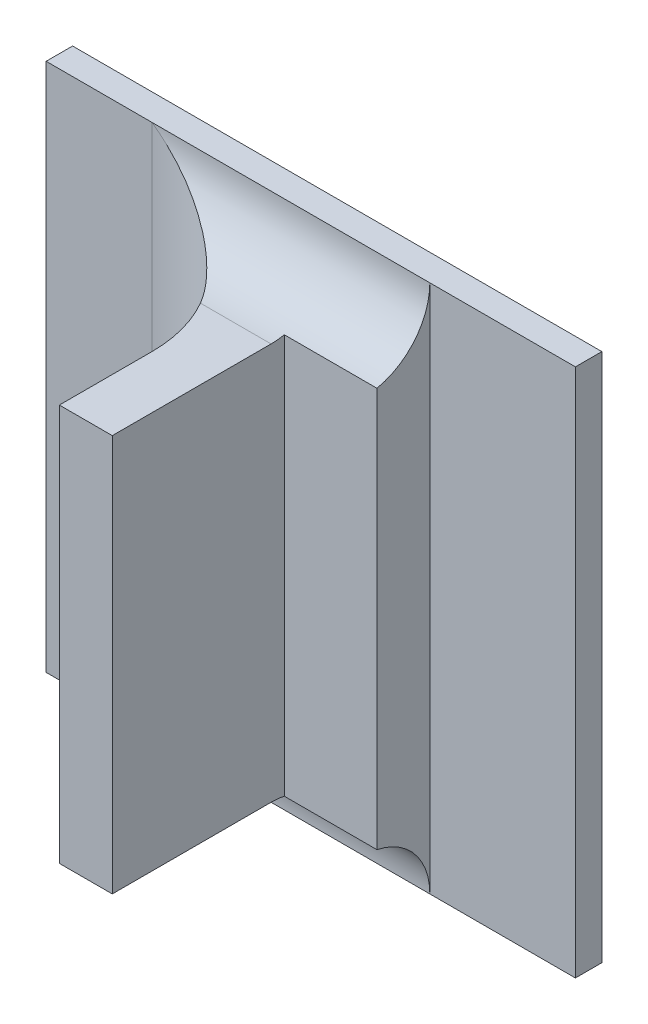
ISO-10303-21;
HEADER;
FILE_DESCRIPTION(('STEP AP214'),'2;1');
FILE_NAME('part.step','',(''),(''),'','','');
FILE_SCHEMA(('AUTOMOTIVE_DESIGN { 1 0 10303 214 1 1 1 1 }'));
ENDSEC;
DATA;
#1=APPLICATION_CONTEXT('core data for automotive mechanical design processes');
#2=APPLICATION_PROTOCOL_DEFINITION('international standard','automotive_design',2000,#1);
#3=PRODUCT_CONTEXT('',#1,'mechanical');
#4=PRODUCT('Part','Part','',(#3));
#5=PRODUCT_RELATED_PRODUCT_CATEGORY('part','',(#4));
#6=PRODUCT_DEFINITION_FORMATION('','',#4);
#7=PRODUCT_DEFINITION_CONTEXT('part definition',#1,'design');
#8=PRODUCT_DEFINITION('design','',#6,#7);
#9=PRODUCT_DEFINITION_SHAPE('','',#8);
#10=(LENGTH_UNIT() NAMED_UNIT(*) SI_UNIT(.MILLI.,.METRE.));
#11=(NAMED_UNIT(*) PLANE_ANGLE_UNIT() SI_UNIT($,.RADIAN.));
#12=(NAMED_UNIT(*) SI_UNIT($,.STERADIAN.) SOLID_ANGLE_UNIT());
#13=UNCERTAINTY_MEASURE_WITH_UNIT(LENGTH_MEASURE(1.E-05),#10,'distance_accuracy_value','');
#14=(GEOMETRIC_REPRESENTATION_CONTEXT(3) GLOBAL_UNCERTAINTY_ASSIGNED_CONTEXT((#13)) GLOBAL_UNIT_ASSIGNED_CONTEXT((#10,
#11,#12)) REPRESENTATION_CONTEXT('',''));
#15=CARTESIAN_POINT('',(0.,0.,0.));
#16=DIRECTION('',(0.,0.,1.));
#17=DIRECTION('',(1.,0.,0.));
#18=AXIS2_PLACEMENT_3D('',#15,#16,#17);
#19=CARTESIAN_POINT('',(0.959904218627624,-0.311549667580545,0.0888870078740156));
#20=DIRECTION('',(0.,0.,1.));
#21=DIRECTION('',(1.,0.,0.));
#22=AXIS2_PLACEMENT_3D('',#19,#20,#21);
#23=PLANE('',#22);
#24=DIRECTION('',(1.,0.,0.));
#25=VECTOR('',#24,1.);
#26=CARTESIAN_POINT('',(0.952588649165875,-0.351234706950624,0.0888870078740156));
#27=LINE('',#26,#25);
#28=CARTESIAN_POINT('',(0.959652250123687,-0.351234706950624,0.0888870078740156));
#29=VERTEX_POINT('',#28);
#30=CARTESIAN_POINT('',(0.954612880044947,-0.351234706950624,0.0888870078740156));
#31=VERTEX_POINT('',#30);
#32=EDGE_CURVE('E193',#29,#31,#27,.F.);
#33=ORIENTED_EDGE('',*,*,#32,.F.);
#34=DIRECTION('',(0.,1.,0.));
#35=VECTOR('',#34,1.);
#36=CARTESIAN_POINT('',(0.959652250123687,-0.35326446766354,0.0888870078740156));
#37=LINE('',#36,#35);
#38=CARTESIAN_POINT('',(0.959652250123687,-0.313439431360073,0.0888870078740156));
#39=VERTEX_POINT('',#38);
#40=EDGE_CURVE('E187',#39,#29,#37,.F.);
#41=ORIENTED_EDGE('',*,*,#40,.F.);
#42=DIRECTION('',(1.,0.,0.));
#43=VECTOR('',#42,1.);
#44=CARTESIAN_POINT('',(0.952588649165875,-0.313439431360073,0.0888870078740156));
#45=LINE('',#44,#43);
#46=CARTESIAN_POINT('',(0.954612880044947,-0.313439431360073,0.0888870078740156));
#47=VERTEX_POINT('',#46);
#48=EDGE_CURVE('E180',#39,#47,#45,.F.);
#49=ORIENTED_EDGE('',*,*,#48,.T.);
#50=DIRECTION('',(0.,-1.,0.));
#51=VECTOR('',#50,1.);
#52=CARTESIAN_POINT('',(0.954612880044947,-0.311549667580545,0.0888870078740156));
#53=LINE('',#52,#51);
#54=EDGE_CURVE('E177',#31,#47,#53,.F.);
#55=ORIENTED_EDGE('',*,*,#54,.F.);
#56=EDGE_LOOP('',(#33,#41,#49,#55));
#57=FACE_BOUND('',#56,.T.);
#58=ADVANCED_FACE('F17',(#57),#23,.T.);
#59=CARTESIAN_POINT('',(0.954612880044947,-0.311549667580545,0.0796271653543306));
#60=DIRECTION('',(-1.,0.,0.));
#61=DIRECTION('',(0.,-1.,0.));
#62=AXIS2_PLACEMENT_3D('',#59,#60,#61);
#63=PLANE('',#62);
#64=DIRECTION('',(0.,0.,1.));
#65=VECTOR('',#64,1.);
#66=CARTESIAN_POINT('',(0.954612880044947,-0.313439431360073,0.0730129921259841));
#67=LINE('',#66,#65);
#68=CARTESIAN_POINT('',(0.954612880044947,-0.313439431360073,0.0800681102362204));
#69=VERTEX_POINT('',#68);
#70=EDGE_CURVE('E184',#47,#69,#67,.F.);
#71=ORIENTED_EDGE('',*,*,#70,.T.);
#72=DIRECTION('',(0.,1.,0.));
#73=VECTOR('',#72,1.);
#74=CARTESIAN_POINT('',(0.954612880044946,-0.360053604588419,0.0800681102362204));
#75=LINE('',#74,#73);
#76=CARTESIAN_POINT('',(0.954612880044947,-0.351234706950624,0.0800681102362204));
#77=VERTEX_POINT('',#76);
#78=EDGE_CURVE('E127',#69,#77,#75,.F.);
#79=ORIENTED_EDGE('',*,*,#78,.T.);
#80=DIRECTION('',(0.,0.,1.));
#81=VECTOR('',#80,1.);
#82=CARTESIAN_POINT('',(0.954612880044947,-0.351234706950624,0.0730129921259841));
#83=LINE('',#82,#81);
#84=EDGE_CURVE('E196',#31,#77,#83,.F.);
#85=ORIENTED_EDGE('',*,*,#84,.F.);
#86=ORIENTED_EDGE('',*,*,#54,.T.);
#87=EDGE_LOOP('',(#71,#79,#85,#86));
#88=FACE_BOUND('',#87,.T.);
#89=ADVANCED_FACE('F242',(#88),#63,.T.);
#90=CARTESIAN_POINT('',(0.952588649165875,-0.313439431360073,0.0730129921259841));
#91=DIRECTION('',(0.,-1.,0.));
#92=DIRECTION('',(1.,0.,0.));
#93=AXIS2_PLACEMENT_3D('',#90,#91,#92);
#94=PLANE('',#93);
#95=ORIENTED_EDGE('',*,*,#70,.F.);
#96=ORIENTED_EDGE('',*,*,#48,.F.);
#97=DIRECTION('',(0.,0.,1.));
#98=VECTOR('',#97,1.);
#99=CARTESIAN_POINT('',(0.959652250123687,-0.313439431360073,0.0716901574803148));
#100=LINE('',#99,#98);
#101=CARTESIAN_POINT('',(0.959652250123687,-0.313439431360073,0.0737688976377952));
#102=VERTEX_POINT('',#101);
#103=EDGE_CURVE('E115',#102,#39,#100,.T.);
#104=ORIENTED_EDGE('',*,*,#103,.F.);
#105=DIRECTION('',(1.,0.,0.));
#106=VECTOR('',#105,1.);
#107=CARTESIAN_POINT('',(0.940691620202427,-0.313439431360073,0.0737688976377952));
#108=LINE('',#107,#106);
#109=CARTESIAN_POINT('',(0.952925011116247,-0.313439431360073,0.0737688976377952));
#110=VERTEX_POINT('',#109);
#111=EDGE_CURVE('E109',#102,#110,#108,.F.);
#112=ORIENTED_EDGE('',*,*,#111,.T.);
#113=CARTESIAN_POINT('',(0.942014454848096,-0.313439431360073,0.0800681102362204));
#114=DIRECTION('',(0.,1.,0.));
#115=DIRECTION('',(-1.,0.,0.));
#116=AXIS2_PLACEMENT_3D('',#113,#114,#115);
#117=CIRCLE('',#116,0.0125984251968504);
#118=EDGE_CURVE('E20',#110,#69,#117,.F.);
#119=ORIENTED_EDGE('',*,*,#118,.T.);
#120=EDGE_LOOP('',(#95,#96,#104,#112,#119));
#121=FACE_BOUND('',#120,.T.);
#122=ADVANCED_FACE('F112',(#121),#94,.F.);
#123=CARTESIAN_POINT('',(0.952588649165875,-0.351234706950624,0.0730129921259841));
#124=DIRECTION('',(0.,-1.,0.));
#125=DIRECTION('',(1.,0.,0.));
#126=AXIS2_PLACEMENT_3D('',#123,#124,#125);
#127=PLANE('',#126);
#128=CARTESIAN_POINT('',(0.942014454848096,-0.351234706950624,0.0800681102362204));
#129=DIRECTION('',(0.,1.,0.));
#130=DIRECTION('',(-1.,0.,0.));
#131=AXIS2_PLACEMENT_3D('',#128,#129,#130);
#132=CIRCLE('',#131,0.0125984251968504);
#133=CARTESIAN_POINT('',(0.952925011117406,-0.351234706946846,0.0737688976346622));
#134=VERTEX_POINT('',#133);
#135=EDGE_CURVE('E121',#77,#134,#132,.T.);
#136=ORIENTED_EDGE('',*,*,#135,.T.);
#137=DIRECTION('',(-1.,0.,0.));
#138=VECTOR('',#137,1.);
#139=CARTESIAN_POINT('',(0.994927840674868,-0.351234706950624,0.0737688976377952));
#140=LINE('',#139,#138);
#141=CARTESIAN_POINT('',(0.959652250123687,-0.351234706950624,0.0737688976377952));
#142=VERTEX_POINT('',#141);
#143=EDGE_CURVE('E169',#134,#142,#140,.F.);
#144=ORIENTED_EDGE('',*,*,#143,.T.);
#145=DIRECTION('',(0.,0.,1.));
#146=VECTOR('',#145,1.);
#147=CARTESIAN_POINT('',(0.959652250123687,-0.351234706950624,0.0716901574803148));
#148=LINE('',#147,#146);
#149=EDGE_CURVE('E190',#29,#142,#148,.F.);
#150=ORIENTED_EDGE('',*,*,#149,.F.);
#151=ORIENTED_EDGE('',*,*,#32,.T.);
#152=ORIENTED_EDGE('',*,*,#84,.T.);
#153=EDGE_LOOP('',(#136,#144,#150,#151,#152));
#154=FACE_BOUND('',#153,.T.);
#155=ADVANCED_FACE('F235',(#154),#127,.T.);
#156=CARTESIAN_POINT('',(0.959652250123687,-0.35326446766354,0.0716901574803148));
#157=DIRECTION('',(1.,0.,0.));
#158=DIRECTION('',(0.,1.,0.));
#159=AXIS2_PLACEMENT_3D('',#156,#157,#158);
#160=PLANE('',#159);
#161=DIRECTION('',(0.,1.,0.));
#162=VECTOR('',#161,1.);
#163=CARTESIAN_POINT('',(0.959652250123687,-0.311409670647157,0.0725090551181101));
#164=LINE('',#163,#162);
#165=CARTESIAN_POINT('',(0.959652250123687,-0.313312161420629,0.0725090551181101));
#166=VERTEX_POINT('',#165);
#167=CARTESIAN_POINT('',(0.959652250123687,-0.351361976890068,0.0725090551181101));
#168=VERTEX_POINT('',#167);
#169=EDGE_CURVE('E216',#166,#168,#164,.F.);
#170=ORIENTED_EDGE('',*,*,#169,.F.);
#171=CARTESIAN_POINT('',(0.959652250123687,-0.313312161420629,0.0725090551181101));
#172=CARTESIAN_POINT('',(0.959652250123687,-0.313439431360073,0.0731325479405746));
#173=CARTESIAN_POINT('',(0.959652250123687,-0.313439431360073,0.0737688976377952));
#174=B_SPLINE_CURVE_WITH_KNOTS('',2,(#171,#172,#173),.UNSPECIFIED.,.F.,.F.,(3,3),(0.,1.),.UNSPECIFIED.);
#175=EDGE_CURVE('E217',#166,#102,#174,.T.);
#176=ORIENTED_EDGE('',*,*,#175,.T.);
#177=ORIENTED_EDGE('',*,*,#103,.T.);
#178=ORIENTED_EDGE('',*,*,#40,.T.);
#179=ORIENTED_EDGE('',*,*,#149,.T.);
#180=CARTESIAN_POINT('',(0.959652250123687,-0.351234706950624,0.0737688976377952));
#181=CARTESIAN_POINT('',(0.959652250123687,-0.351234706950624,0.0731325479405747));
#182=CARTESIAN_POINT('',(0.959652250123687,-0.351361976890068,0.0725090551181101));
#183=B_SPLINE_CURVE_WITH_KNOTS('',2,(#180,#181,#182),.UNSPECIFIED.,.F.,.F.,(3,3),(0.,1.),.UNSPECIFIED.);
#184=EDGE_CURVE('E221',#142,#168,#183,.T.);
#185=ORIENTED_EDGE('',*,*,#184,.T.);
#186=EDGE_LOOP('',(#170,#176,#177,#178,#179,#185));
#187=FACE_BOUND('',#186,.T.);
#188=ADVANCED_FACE('F224',(#187),#160,.T.);
#189=CARTESIAN_POINT('',(0.968912092643372,-0.311409670647157,0.0725090551181101));
#190=DIRECTION('',(0.,0.,1.));
#191=DIRECTION('',(1.,0.,0.));
#192=AXIS2_PLACEMENT_3D('',#189,#190,#191);
#193=PLANE('',#192);
#194=DIRECTION('',(0.,1.,0.));
#195=VECTOR('',#194,1.);
#196=CARTESIAN_POINT('',(0.968471147761482,-0.304620533722278,0.0725090551181101));
#197=LINE('',#196,#195);
#198=CARTESIAN_POINT('',(0.968471147761482,-0.313312161420629,0.0725090551181101));
#199=VERTEX_POINT('',#198);
#200=CARTESIAN_POINT('',(0.968471147761482,-0.351361976890068,0.0725090551181101));
#201=VERTEX_POINT('',#200);
#202=EDGE_CURVE('E128',#199,#201,#197,.F.);
#203=ORIENTED_EDGE('',*,*,#202,.F.);
#204=DIRECTION('',(1.,0.,0.));
#205=VECTOR('',#204,1.);
#206=CARTESIAN_POINT('',(0.940691620202427,-0.313312161420629,0.0725090551181101));
#207=LINE('',#206,#205);
#208=EDGE_CURVE('E139',#199,#166,#207,.F.);
#209=ORIENTED_EDGE('',*,*,#208,.T.);
#210=ORIENTED_EDGE('',*,*,#169,.T.);
#211=DIRECTION('',(-1.,0.,0.));
#212=VECTOR('',#211,1.);
#213=CARTESIAN_POINT('',(0.994927840674868,-0.351361976890068,0.0725090551181101));
#214=LINE('',#213,#212);
#215=EDGE_CURVE('E174',#168,#201,#214,.F.);
#216=ORIENTED_EDGE('',*,*,#215,.T.);
#217=EDGE_LOOP('',(#203,#209,#210,#216));
#218=FACE_BOUND('',#217,.T.);
#219=ADVANCED_FACE('F234',(#218),#193,.T.);
#220=CARTESIAN_POINT('',(0.968471147761482,-0.304620533722278,0.067217716535433));
#221=DIRECTION('',(1.,0.,0.));
#222=DIRECTION('',(0.,1.,0.));
#223=AXIS2_PLACEMENT_3D('',#220,#221,#222);
#224=PLANE('',#223);
#225=DIRECTION('',(0.,1.,0.));
#226=VECTOR('',#225,1.);
#227=CARTESIAN_POINT('',(0.968471147761482,-0.304620533722278,0.06746968503937));
#228=LINE('',#227,#226);
#229=CARTESIAN_POINT('',(0.968471147761482,-0.357533919549049,0.06746968503937));
#230=VERTEX_POINT('',#229);
#231=CARTESIAN_POINT('',(0.968471147761482,-0.307140218761648,0.06746968503937));
#232=VERTEX_POINT('',#231);
#233=EDGE_CURVE('E170',#230,#232,#228,.T.);
#234=ORIENTED_EDGE('',*,*,#233,.T.);
#235=CARTESIAN_POINT('',(0.968471147761482,-0.307140218761648,0.0737688976377952));
#236=DIRECTION('',(1.,0.,0.));
#237=DIRECTION('',(0.,1.,0.));
#238=AXIS2_PLACEMENT_3D('',#235,#236,#237);
#239=CIRCLE('',#238,0.0062992125984252);
#240=EDGE_CURVE('E136',#232,#199,#239,.F.);
#241=ORIENTED_EDGE('',*,*,#240,.T.);
#242=ORIENTED_EDGE('',*,*,#202,.T.);
#243=CARTESIAN_POINT('',(0.968471147761482,-0.357533919549049,0.0737688976377952));
#244=DIRECTION('',(-1.,0.,0.));
#245=DIRECTION('',(0.,-1.,0.));
#246=AXIS2_PLACEMENT_3D('',#243,#244,#245);
#247=CIRCLE('',#246,0.0062992125984252);
#248=EDGE_CURVE('E171',#201,#230,#247,.T.);
#249=ORIENTED_EDGE('',*,*,#248,.T.);
#250=EDGE_LOOP('',(#234,#241,#242,#249));
#251=FACE_BOUND('',#250,.T.);
#252=ADVANCED_FACE('F318',(#251),#224,.T.);
#253=CARTESIAN_POINT('',(0.942014454848096,-0.360053604588419,0.0800681102362204));
#254=DIRECTION('',(0.,1.,0.));
#255=DIRECTION('',(-1.,0.,0.));
#256=AXIS2_PLACEMENT_3D('',#253,#254,#255);
#257=CYLINDRICAL_SURFACE('',#256,0.0125984251968504);
#258=ORIENTED_EDGE('',*,*,#78,.F.);
#259=ORIENTED_EDGE('',*,*,#118,.F.);
#260=CARTESIAN_POINT('',(0.952925011116247,-0.313439431360073,0.0737688976377955));
#261=CARTESIAN_POINT('',(0.952652526611767,-0.313438873707853,0.0732955457546596));
#262=CARTESIAN_POINT('',(0.952350414486163,-0.313386346377414,0.0728445682080302));
#263=CARTESIAN_POINT('',(0.951704946712163,-0.313201363699116,0.0720003898002668));
#264=CARTESIAN_POINT('',(0.951362214236907,-0.313070015578846,0.0716064807283958));
#265=CARTESIAN_POINT('',(0.950576977112133,-0.312719656172453,0.0708064921171967));
#266=CARTESIAN_POINT('',(0.95012790598383,-0.312488708936628,0.0704123993317737));
#267=CARTESIAN_POINT('',(0.949197979722231,-0.311970610304802,0.0697017381084186));
#268=CARTESIAN_POINT('',(0.948716946451534,-0.311683122697779,0.0693856602556571));
#269=CARTESIAN_POINT('',(0.947536209007032,-0.310946965938326,0.0687164538298329));
#270=CARTESIAN_POINT('',(0.94682693189567,-0.310480210038907,0.0684002761150408));
#271=CARTESIAN_POINT('',(0.945389904180813,-0.309508649017801,0.0679065689436591));
#272=CARTESIAN_POINT('',(0.944662185421036,-0.309003906866001,0.0677288153407499));
#273=CARTESIAN_POINT('',(0.943486222851557,-0.308179722442744,0.0675478835698786));
#274=CARTESIAN_POINT('',(0.943040368067287,-0.307865289365079,0.0675035718032503));
#275=CARTESIAN_POINT('',(0.942400947022717,-0.307413510055304,0.0674741343290926));
#276=CARTESIAN_POINT('',(0.942207696373056,-0.307276860634179,0.0674696949622004));
#277=CARTESIAN_POINT('',(0.942014454848096,-0.307140218761648,0.06746968503937));
#278=B_SPLINE_CURVE_WITH_KNOTS('',3,(#260,#261,#262,#263,#264,#265,#266,#267,#268,#269,#270,
#271,#272,#273,#274,#275,#276,#277),.UNSPECIFIED.,.F.,.F.,(4,2,2,2,2,2,2,2,4),(0.,
0.0016282804616354,0.00323420635682065,0.00514617952943918,0.00706988591555775,
0.00977367423346177,0.0124730752253364,0.0141132082090733,0.0148232188039435),.UNSPECIFIED.);
#279=CARTESIAN_POINT('',(0.942014454848096,-0.307140218761648,0.06746968503937));
#280=VERTEX_POINT('',#279);
#281=EDGE_CURVE('E120',#110,#280,#278,.T.);
#282=ORIENTED_EDGE('',*,*,#281,.T.);
#283=DIRECTION('',(0.,1.,0.));
#284=VECTOR('',#283,1.);
#285=CARTESIAN_POINT('',(0.942014454848096,-0.304620533722278,0.06746968503937));
#286=LINE('',#285,#284);
#287=CARTESIAN_POINT('',(0.942014454848096,-0.357533919549049,0.06746968503937));
#288=VERTEX_POINT('',#287);
#289=EDGE_CURVE('E173',#280,#288,#286,.F.);
#290=ORIENTED_EDGE('',*,*,#289,.T.);
#291=CARTESIAN_POINT('',(0.942014454848096,-0.357533919549049,0.06746968503937));
#292=CARTESIAN_POINT('',(0.942014454942411,-0.357533820710529,0.0674696850393615));
#293=CARTESIAN_POINT('',(0.942014465092922,-0.357533721881758,0.0674696850424135));
#294=CARTESIAN_POINT('',(0.94201450093588,-0.357533526955949,0.0674696850532618));
#295=CARTESIAN_POINT('',(0.942014526693925,-0.357533430872243,0.0674696850610781));
#296=CARTESIAN_POINT('',(0.942014590615947,-0.357533240725968,0.0674696850805151));
#297=CARTESIAN_POINT('',(0.942014629033528,-0.357533146750607,0.0674696850922136));
#298=CARTESIAN_POINT('',(0.942014715282516,-0.357532963472809,0.0674696851185221));
#299=CARTESIAN_POINT('',(0.942014763103871,-0.357532874165511,0.067469685133129));
#300=CARTESIAN_POINT('',(0.942014925514867,-0.357532597408358,0.0674696851828237));
#301=CARTESIAN_POINT('',(0.942015052775676,-0.357532417347811,0.0674696852218837));
#302=CARTESIAN_POINT('',(0.942015327608399,-0.35753207672015,0.0674696853066755));
#303=CARTESIAN_POINT('',(0.942015475015549,-0.357531916012994,0.0674696853523532));
#304=CARTESIAN_POINT('',(0.942016002255687,-0.357531378552217,0.0674696855167746));
#305=CARTESIAN_POINT('',(0.942016408447335,-0.35753102736002,0.0674696856452023));
#306=CARTESIAN_POINT('',(0.942017248403296,-0.357530395669093,0.0674696859163221));
#307=CARTESIAN_POINT('',(0.942017680724577,-0.35753011314252,0.0674696860583659));
#308=CARTESIAN_POINT('',(0.942019358901364,-0.357529049504716,0.0674696866214032));
#309=CARTESIAN_POINT('',(0.942020631493958,-0.357528312041991,0.0674696870727233));
#310=CARTESIAN_POINT('',(0.942023105852783,-0.357527004348473,0.0674696882497374));
#311=CARTESIAN_POINT('',(0.942024302626865,-0.357526424850645,0.0674696889448008));
#312=CARTESIAN_POINT('',(0.942032162462908,-0.3575222890615,0.0674696947394657));
#313=CARTESIAN_POINT('',(0.942038113024204,-0.357517528987643,0.067469705198469));
#314=CARTESIAN_POINT('',(0.942060195143193,-0.357500655157769,0.0674697594501571));
#315=CARTESIAN_POINT('',(0.942076839890406,-0.357489442233211,0.0674698297573796));
#316=CARTESIAN_POINT('',(0.942137607634759,-0.357447751356679,0.0674702062030112));
#317=CARTESIAN_POINT('',(0.942181213172839,-0.357416363220397,0.0674707100991553));
#318=CARTESIAN_POINT('',(0.942347580762688,-0.357297373705961,0.0674735003948733));
#319=CARTESIAN_POINT('',(0.942470872950547,-0.357210774630756,0.0674773623702134));
#320=CARTESIAN_POINT('',(0.943510907605976,-0.356479723194322,0.0675251688134003));
#321=CARTESIAN_POINT('',(0.944425463270657,-0.355833313754352,0.0676670910917156));
#322=CARTESIAN_POINT('',(0.946088803867727,-0.354688212740895,0.0681207439021359));
#323=CARTESIAN_POINT('',(0.94684097042269,-0.354182309164853,0.0684021380812103));
#324=CARTESIAN_POINT('',(0.948070882798241,-0.353390736981449,0.069007145077635));
#325=CARTESIAN_POINT('',(0.94855829833037,-0.353086963244752,0.0692872417521839));
#326=CARTESIAN_POINT('',(0.949525367110451,-0.35251559112135,0.0699361732585047));
#327=CARTESIAN_POINT('',(0.950004208130121,-0.352249552770766,0.0703076754457103));
#328=CARTESIAN_POINT('',(0.950802216618258,-0.351850971449622,0.071029025049874));
#329=CARTESIAN_POINT('',(0.951130543730389,-0.351701703110107,0.0713594163896829));
#330=CARTESIAN_POINT('',(0.951754618946584,-0.351458536008311,0.0720638443645076));
#331=CARTESIAN_POINT('',(0.952050614771315,-0.351364188091565,0.0724374961036004));
#332=CARTESIAN_POINT('',(0.95254441238647,-0.35125822393578,0.073141038661769));
#333=CARTESIAN_POINT('',(0.952749768926614,-0.351233374161307,0.0734635869359735));
#334=CARTESIAN_POINT('',(0.953130394087884,-0.35123614841665,0.0741265585439533));
#335=CARTESIAN_POINT('',(0.953305641375077,-0.351263809487217,0.0744669943307327));
#336=CARTESIAN_POINT('',(0.953622285953953,-0.351379458921426,0.0751565544091364));
#337=CARTESIAN_POINT('',(0.953763444772094,-0.351467856546204,0.0755057220621308));
#338=CARTESIAN_POINT('',(0.954008251228329,-0.351709137248076,0.0761947785868874));
#339=CARTESIAN_POINT('',(0.954111926493993,-0.351861972650039,0.0765346741211982));
#340=CARTESIAN_POINT('',(0.954273630206616,-0.352208066365581,0.0771489075153617));
#341=CARTESIAN_POINT('',(0.954335649036378,-0.352394251937481,0.0774262133810268));
#342=CARTESIAN_POINT('',(0.954436456604832,-0.352810728056535,0.0779502251276348));
#343=CARTESIAN_POINT('',(0.954475245429573,-0.353041018440312,0.0781969311219235));
#344=CARTESIAN_POINT('',(0.954534515000512,-0.353534827311789,0.0786471201676947));
#345=CARTESIAN_POINT('',(0.954555310743982,-0.3537976779374,0.078851297275294));
#346=CARTESIAN_POINT('',(0.954585360578568,-0.354352704890737,0.0792159384509799));
#347=CARTESIAN_POINT('',(0.954594613095555,-0.354644885212232,0.0793763965548561));
#348=CARTESIAN_POINT('',(0.954606911139442,-0.35526356974645,0.0796549300095399));
#349=CARTESIAN_POINT('',(0.954609683815453,-0.355590994216382,0.0797709755115422));
#350=CARTESIAN_POINT('',(0.954612617356837,-0.35626046880568,0.0799477574285475));
#351=CARTESIAN_POINT('',(0.954612777930303,-0.356602520555389,0.0800084876612566));
#352=CARTESIAN_POINT('',(0.954612924250976,-0.357299291012425,0.0800736589499428));
#353=CARTESIAN_POINT('',(0.954612906221205,-0.357654124542726,0.0800768798691539));
#354=CARTESIAN_POINT('',(0.954612828811268,-0.358359326451429,0.0800238026376847));
#355=CARTESIAN_POINT('',(0.95461276942833,-0.35870969452896,0.0799675004977201));
#356=CARTESIAN_POINT('',(0.954610245926541,-0.359396631022244,0.0797968199531621));
#357=CARTESIAN_POINT('',(0.954607777666631,-0.359733174634292,0.0796823417014521));
#358=CARTESIAN_POINT('',(0.954595871660332,-0.360382201596267,0.0793985331604369));
#359=CARTESIAN_POINT('',(0.954586433662905,-0.360694684079107,0.0792292008955119));
#360=CARTESIAN_POINT('',(0.954554563280116,-0.361284590284202,0.0788419881994159));
#361=CARTESIAN_POINT('',(0.954532209695705,-0.361562214291186,0.078624407062953));
#362=CARTESIAN_POINT('',(0.954467921703294,-0.362076130129699,0.0781473882147605));
#363=CARTESIAN_POINT('',(0.954425994766581,-0.362312437684747,0.0778879664985857));
#364=CARTESIAN_POINT('',(0.954318402202738,-0.36272936533315,0.0773466142760766));
#365=CARTESIAN_POINT('',(0.954253614741515,-0.362911639062123,0.0770657832005055));
#366=CARTESIAN_POINT('',(0.954096353313694,-0.363227051483589,0.0764850450664438));
#367=CARTESIAN_POINT('',(0.954003887850713,-0.363360205239385,0.076185143889188));
#368=CARTESIAN_POINT('',(0.95379296824649,-0.363573336060465,0.0755865038391837));
#369=CARTESIAN_POINT('',(0.953675325351253,-0.363654713885978,0.075287973128724));
#370=CARTESIAN_POINT('',(0.953413610356843,-0.363772258390263,0.0746936193238615));
#371=CARTESIAN_POINT('',(0.95326952438403,-0.363808401257833,0.0743977977367695));
#372=CARTESIAN_POINT('',(0.952947414387391,-0.363840681045031,0.0737980252798641));
#373=CARTESIAN_POINT('',(0.952767793613925,-0.363834066227589,0.0734947949351433));
#374=CARTESIAN_POINT('',(0.952385962831815,-0.363780917647358,0.0729074487273723));
#375=CARTESIAN_POINT('',(0.952183773986872,-0.363734421015531,0.0726233153498298));
#376=CARTESIAN_POINT('',(0.95164906529055,-0.363574978056321,0.0719334846819081));
#377=CARTESIAN_POINT('',(0.951303988698547,-0.363439931691125,0.0715425793781451));
#378=CARTESIAN_POINT('',(0.950579311140119,-0.363111778570927,0.0708143812686401));
#379=CARTESIAN_POINT('',(0.950199372262436,-0.362918049702092,0.0704777252629506));
#380=CARTESIAN_POINT('',(0.94924470638263,-0.362394798667373,0.0697260645086062));
#381=CARTESIAN_POINT('',(0.94865792556896,-0.362043057466804,0.0693419139325726));
#382=CARTESIAN_POINT('',(0.94748304352248,-0.361303652850174,0.0686995101782902));
#383=CARTESIAN_POINT('',(0.946896030787379,-0.360918115997442,0.0684366507296655));
#384=CARTESIAN_POINT('',(0.945747140815674,-0.360145570021453,0.0680209366897774));
#385=CARTESIAN_POINT('',(0.945186220344466,-0.359760395914765,0.0678618837368313));
#386=CARTESIAN_POINT('',(0.943949826274639,-0.358899682153356,0.0676002423539603));
#387=CARTESIAN_POINT('',(0.943272935582448,-0.358420933995823,0.0675142406050074));
#388=CARTESIAN_POINT('',(0.942471394791445,-0.357857414793075,0.0674773844657497));
#389=CARTESIAN_POINT('',(0.942348601933013,-0.357771179502598,0.0674735321464733));
#390=CARTESIAN_POINT('',(0.942182380539893,-0.357652299665764,0.0674707243957125));
#391=CARTESIAN_POINT('',(0.942138419458793,-0.357620653228723,0.0674702128513251));
#392=CARTESIAN_POINT('',(0.942077173838328,-0.357578636461625,0.0674698312735403));
#393=CARTESIAN_POINT('',(0.942060412316417,-0.35756734568902,0.0674697601164235));
#394=CARTESIAN_POINT('',(0.942038191544286,-0.35755036374745,0.0674697053274289));
#395=CARTESIAN_POINT('',(0.942032214589831,-0.357545582177864,0.0674696947878421));
#396=CARTESIAN_POINT('',(0.942024320569576,-0.357541432409255,0.0674696889590613));
#397=CARTESIAN_POINT('',(0.942023120617715,-0.357540851977146,0.0674696882612312));
#398=CARTESIAN_POINT('',(0.942020639784349,-0.357539541235211,0.0674696870796236));
#399=CARTESIAN_POINT('',(0.942019363956671,-0.357538801537495,0.0674696866266876));
#400=CARTESIAN_POINT('',(0.942017682120959,-0.357537734689543,0.0674696860616838));
#401=CARTESIAN_POINT('',(0.942017249161649,-0.357537451484008,0.0674696859192267));
#402=CARTESIAN_POINT('',(0.942016408088211,-0.357536818171936,0.0674696856472792));
#403=CARTESIAN_POINT('',(0.942016001426724,-0.357536466026408,0.0674696855184389));
#404=CARTESIAN_POINT('',(0.942015473777343,-0.357535927161507,0.0674696853534853));
#405=CARTESIAN_POINT('',(0.942015326307243,-0.357535766073566,0.067469685307667));
#406=CARTESIAN_POINT('',(0.942015051427792,-0.357535424647299,0.0674696852226042));
#407=CARTESIAN_POINT('',(0.94201492418412,-0.357535244168447,0.0674696851834138));
#408=CARTESIAN_POINT('',(0.942014761887342,-0.357534966802438,0.0674696851335454));
#409=CARTESIAN_POINT('',(0.942014714117432,-0.357534877309405,0.067469685118887));
#410=CARTESIAN_POINT('',(0.942014628001885,-0.357534693660717,0.0674696850924812));
#411=CARTESIAN_POINT('',(0.94201458966636,-0.357534599500188,0.067469685080737));
#412=CARTESIAN_POINT('',(0.94201452594532,-0.357534408998662,0.067469685061218));
#413=CARTESIAN_POINT('',(0.942014500304971,-0.357534312744865,0.0674696850533652));
#414=CARTESIAN_POINT('',(0.942014464742129,-0.357534117498272,0.0674696850424555));
#415=CARTESIAN_POINT('',(0.942014454753656,-0.357534018518773,0.0674696850393785));
#416=CARTESIAN_POINT('',(0.942014454848096,-0.357533919549049,0.06746968503937));
#417=B_SPLINE_CURVE_WITH_KNOTS('',3,(#291,#292,#293,#294,#295,#296,#297,#298,#299,#300,#301,
#302,#303,#304,#305,#306,#307,#308,#309,#310,#311,#312,#313,#314,#315,#316,#317,#318,#319,#320,
#321,#322,#323,#324,#325,#326,#327,#328,#329,#330,#331,#332,#333,#334,#335,#336,#337,#338,#339,
#340,#341,#342,#343,#344,#345,#346,#347,#348,#349,#350,#351,#352,#353,#354,#355,#356,#357,#358,
#359,#360,#361,#362,#363,#364,#365,#366,#367,#368,#369,#370,#371,#372,#373,#374,#375,#376,#377,
#378,#379,#380,#381,#382,#383,#384,#385,#386,#387,#388,#389,#390,#391,#392,#393,#394,#395,#396,
#397,#398,#399,#400,#401,#402,#403,#404,#405,#406,#407,#408,#409,#410,#411,#412,#413,#414,#415,
#416),.UNSPECIFIED.,.T.,.F.,(4,2,2,2,2,2,2,2,2,2,2,2,2,2,2,2,2,2,2,2,2,2,2,2,2,2,2,2,2,2,2,2,2,
2,2,2,2,2,2,2,2,2,2,2,2,2,2,2,2,2,2,2,2,2,2,2,2,2,2,2,2,2,4),(0.,2.96262718531282E-07,
5.93779356084953E-07,8.97660571560522E-07,1.20121869982473E-06,1.85983939935459E-06,
2.51336440039036E-06,4.11695718370899E-06,5.66498675238959E-06,1.00742722996315E-05,
1.40586629769216E-05,3.67471450072809E-05,9.70745534320095E-05,0.000258117828158631,
0.000710418104869189,0.00407475533961836,0.00690809627288608,0.00881968522125084,
0.0107955574621808,0.0122580167053818,0.0137083411294309,0.0148534027078704,0.0159992723041917,
0.0171529398267011,0.0183057552869513,0.019319916651791,0.0203340742599355,0.0213300957694084,
0.0223262530896368,0.0233636546164693,0.0244011720739371,0.0254606762934847,0.0265202515263764,
0.0275816514712125,0.0286430896476358,0.0296981191234644,0.0307527462159097,0.031770621479094,
0.032788184337071,0.0337768943877515,0.0347661246662932,0.0358196249691739,0.0368721455004047,
0.0384790134244906,0.0401035507750211,0.0424440092075655,0.0446862628276773,0.0467780451238265,
0.0492693497424133,0.0497197817321133,0.0498821419378974,0.0499428919104112,0.0499656810460579,
0.0499696752051924,0.0499740961721066,0.0499756469097011,0.0499772533934871,0.0499779078855007,
0.0499785674893831,0.049978871464854,0.0499791757647539,0.0499794736800123,0.0499797703360084),.UNSPECIFIED.);
#418=EDGE_CURVE('E163',#288,#134,#417,.T.);
#419=ORIENTED_EDGE('',*,*,#418,.T.);
#420=ORIENTED_EDGE('',*,*,#135,.F.);
#421=EDGE_LOOP('',(#258,#259,#282,#290,#419,#420));
#422=FACE_BOUND('',#421,.T.);
#423=ADVANCED_FACE('F124',(#422),#257,.F.);
#424=CARTESIAN_POINT('',(0.940691620202427,-0.307140218761648,0.0737688976377952));
#425=DIRECTION('',(1.,0.,0.));
#426=DIRECTION('',(0.,1.,0.));
#427=AXIS2_PLACEMENT_3D('',#424,#425,#426);
#428=CYLINDRICAL_SURFACE('',#427,0.0062992125984252);
#429=ORIENTED_EDGE('',*,*,#208,.F.);
#430=ORIENTED_EDGE('',*,*,#240,.F.);
#431=DIRECTION('',(-1.,0.,0.));
#432=VECTOR('',#431,1.);
#433=CARTESIAN_POINT('',(0.984849100517388,-0.307140218761648,0.06746968503937));
#434=LINE('',#433,#432);
#435=EDGE_CURVE('E134',#280,#232,#434,.F.);
#436=ORIENTED_EDGE('',*,*,#435,.F.);
#437=ORIENTED_EDGE('',*,*,#281,.F.);
#438=ORIENTED_EDGE('',*,*,#111,.F.);
#439=ORIENTED_EDGE('',*,*,#175,.F.);
#440=EDGE_LOOP('',(#429,#430,#436,#437,#438,#439));
#441=FACE_BOUND('',#440,.T.);
#442=ADVANCED_FACE('F131',(#441),#428,.F.);
#443=CARTESIAN_POINT('',(0.967778234375655,-0.304620533722278,0.06746968503937));
#444=DIRECTION('',(0.,0.,-1.));
#445=DIRECTION('',(-1.,0.,0.));
#446=AXIS2_PLACEMENT_3D('',#443,#444,#445);
#447=PLANE('',#446);
#448=DIRECTION('',(0.,1.,0.));
#449=VECTOR('',#448,1.);
#450=CARTESIAN_POINT('',(0.982329415478018,-0.36005360458842,0.06746968503937));
#451=LINE('',#450,#449);
#452=CARTESIAN_POINT('',(0.982329415478018,-0.307140218761648,0.06746968503937));
#453=VERTEX_POINT('',#452);
#454=CARTESIAN_POINT('',(0.982329415478018,-0.357533919549049,0.06746968503937));
#455=VERTEX_POINT('',#454);
#456=EDGE_CURVE('E281',#453,#455,#451,.F.);
#457=ORIENTED_EDGE('',*,*,#456,.F.);
#458=DIRECTION('',(-1.,0.,0.));
#459=VECTOR('',#458,1.);
#460=CARTESIAN_POINT('',(0.984849100517388,-0.307140218761648,0.06746968503937));
#461=LINE('',#460,#459);
#462=EDGE_CURVE('E206',#232,#453,#461,.F.);
#463=ORIENTED_EDGE('',*,*,#462,.F.);
#464=ORIENTED_EDGE('',*,*,#233,.F.);
#465=DIRECTION('',(1.,0.,0.));
#466=VECTOR('',#465,1.);
#467=CARTESIAN_POINT('',(0.929416029651246,-0.357533919549049,0.06746968503937));
#468=LINE('',#467,#466);
#469=EDGE_CURVE('E283',#455,#230,#468,.F.);
#470=ORIENTED_EDGE('',*,*,#469,.F.);
#471=EDGE_LOOP('',(#457,#463,#464,#470));
#472=FACE_BOUND('',#471,.T.);
#473=ADVANCED_FACE('F152',(#472),#447,.F.);
#474=CARTESIAN_POINT('',(0.994927840674868,-0.357533919549049,0.0737688976377952));
#475=DIRECTION('',(-1.,0.,0.));
#476=DIRECTION('',(0.,-1.,0.));
#477=AXIS2_PLACEMENT_3D('',#474,#475,#476);
#478=CYLINDRICAL_SURFACE('',#477,0.0062992125984252);
#479=ORIENTED_EDGE('',*,*,#215,.F.);
#480=ORIENTED_EDGE('',*,*,#184,.F.);
#481=ORIENTED_EDGE('',*,*,#143,.F.);
#482=ORIENTED_EDGE('',*,*,#418,.F.);
#483=DIRECTION('',(1.,0.,0.));
#484=VECTOR('',#483,1.);
#485=CARTESIAN_POINT('',(0.929416029651246,-0.357533919549049,0.06746968503937));
#486=LINE('',#485,#484);
#487=EDGE_CURVE('E303',#230,#288,#486,.F.);
#488=ORIENTED_EDGE('',*,*,#487,.F.);
#489=ORIENTED_EDGE('',*,*,#248,.F.);
#490=EDGE_LOOP('',(#479,#480,#481,#482,#488,#489));
#491=FACE_BOUND('',#490,.T.);
#492=ADVANCED_FACE('F155',(#491),#478,.F.);
#493=CARTESIAN_POINT('',(0.931431777682742,-0.304620533722278,0.06746968503937));
#494=DIRECTION('',(0.,0.,-1.));
#495=DIRECTION('',(-1.,0.,0.));
#496=AXIS2_PLACEMENT_3D('',#493,#494,#495);
#497=PLANE('',#496);
#498=DIRECTION('',(-1.,0.,0.));
#499=VECTOR('',#498,1.);
#500=CARTESIAN_POINT('',(0.984849100517388,-0.307140218761648,0.06746968503937));
#501=LINE('',#500,#499);
#502=CARTESIAN_POINT('',(0.931935714690616,-0.307140218761648,0.06746968503937));
#503=VERTEX_POINT('',#502);
#504=EDGE_CURVE('E298',#503,#280,#501,.F.);
#505=ORIENTED_EDGE('',*,*,#504,.F.);
#506=DIRECTION('',(0.,-1.,0.));
#507=VECTOR('',#506,1.);
#508=CARTESIAN_POINT('',(0.931935714690616,-0.304620533722278,0.06746968503937));
#509=LINE('',#508,#507);
#510=CARTESIAN_POINT('',(0.931935714690616,-0.357533919549049,0.06746968503937));
#511=VERTEX_POINT('',#510);
#512=EDGE_CURVE('E325',#511,#503,#509,.F.);
#513=ORIENTED_EDGE('',*,*,#512,.F.);
#514=DIRECTION('',(1.,0.,0.));
#515=VECTOR('',#514,1.);
#516=CARTESIAN_POINT('',(0.929416029651246,-0.357533919549049,0.06746968503937));
#517=LINE('',#516,#515);
#518=EDGE_CURVE('E301',#288,#511,#517,.F.);
#519=ORIENTED_EDGE('',*,*,#518,.F.);
#520=ORIENTED_EDGE('',*,*,#289,.F.);
#521=EDGE_LOOP('',(#505,#513,#519,#520));
#522=FACE_BOUND('',#521,.T.);
#523=ADVANCED_FACE('F160',(#522),#497,.F.);
#524=CARTESIAN_POINT('',(0.984849100517388,-0.307140218761648,0.0648240157480314));
#525=DIRECTION('',(0.,1.,0.));
#526=DIRECTION('',(-1.,0.,0.));
#527=AXIS2_PLACEMENT_3D('',#524,#525,#526);
#528=PLANE('',#527);
#529=ORIENTED_EDGE('',*,*,#462,.T.);
#530=DIRECTION('',(0.,0.,1.));
#531=VECTOR('',#530,1.);
#532=CARTESIAN_POINT('',(0.982329415478018,-0.307140218761648,0.0648240157480314));
#533=LINE('',#532,#531);
#534=CARTESIAN_POINT('',(0.982329415478018,-0.307140218761648,0.0649499999999999));
#535=VERTEX_POINT('',#534);
#536=EDGE_CURVE('E208',#535,#453,#533,.T.);
#537=ORIENTED_EDGE('',*,*,#536,.F.);
#538=DIRECTION('',(-1.,0.,0.));
#539=VECTOR('',#538,1.);
#540=CARTESIAN_POINT('',(0.929416029651246,-0.307140218761648,0.0649499999999999));
#541=LINE('',#540,#539);
#542=CARTESIAN_POINT('',(0.931935714690616,-0.307140218761648,0.0649499999999999));
#543=VERTEX_POINT('',#542);
#544=EDGE_CURVE('E332',#543,#535,#541,.F.);
#545=ORIENTED_EDGE('',*,*,#544,.F.);
#546=DIRECTION('',(0.,0.,1.));
#547=VECTOR('',#546,1.);
#548=CARTESIAN_POINT('',(0.931935714690616,-0.307140218761648,0.0648240157480314));
#549=LINE('',#548,#547);
#550=EDGE_CURVE('E329',#503,#543,#549,.F.);
#551=ORIENTED_EDGE('',*,*,#550,.F.);
#552=ORIENTED_EDGE('',*,*,#504,.T.);
#553=ORIENTED_EDGE('',*,*,#435,.T.);
#554=EDGE_LOOP('',(#529,#537,#545,#551,#552,#553));
#555=FACE_BOUND('',#554,.T.);
#556=ADVANCED_FACE('F267',(#555),#528,.T.);
#557=CARTESIAN_POINT('',(0.982329415478018,-0.36005360458842,0.0648240157480314));
#558=DIRECTION('',(1.,0.,0.));
#559=DIRECTION('',(0.,1.,0.));
#560=AXIS2_PLACEMENT_3D('',#557,#558,#559);
#561=PLANE('',#560);
#562=ORIENTED_EDGE('',*,*,#456,.T.);
#563=DIRECTION('',(0.,0.,1.));
#564=VECTOR('',#563,1.);
#565=CARTESIAN_POINT('',(0.982329415478018,-0.357533919549049,0.0648240157480314));
#566=LINE('',#565,#564);
#567=CARTESIAN_POINT('',(0.982329415478018,-0.357533919549049,0.0649499999999999));
#568=VERTEX_POINT('',#567);
#569=EDGE_CURVE('E285',#568,#455,#566,.T.);
#570=ORIENTED_EDGE('',*,*,#569,.F.);
#571=DIRECTION('',(0.,1.,0.));
#572=VECTOR('',#571,1.);
#573=CARTESIAN_POINT('',(0.982329415478018,-0.304620533722278,0.0649499999999999));
#574=LINE('',#573,#572);
#575=EDGE_CURVE('E288',#535,#568,#574,.F.);
#576=ORIENTED_EDGE('',*,*,#575,.F.);
#577=ORIENTED_EDGE('',*,*,#536,.T.);
#578=EDGE_LOOP('',(#562,#570,#576,#577));
#579=FACE_BOUND('',#578,.T.);
#580=ADVANCED_FACE('F265',(#579),#561,.T.);
#581=CARTESIAN_POINT('',(0.929416029651246,-0.357533919549049,0.0648240157480314));
#582=DIRECTION('',(0.,-1.,0.));
#583=DIRECTION('',(1.,0.,0.));
#584=AXIS2_PLACEMENT_3D('',#581,#582,#583);
#585=PLANE('',#584);
#586=ORIENTED_EDGE('',*,*,#518,.T.);
#587=DIRECTION('',(0.,0.,1.));
#588=VECTOR('',#587,1.);
#589=CARTESIAN_POINT('',(0.931935714690616,-0.357533919549049,0.0648240157480314));
#590=LINE('',#589,#588);
#591=CARTESIAN_POINT('',(0.931935714690616,-0.357533919549049,0.0649499999999999));
#592=VERTEX_POINT('',#591);
#593=EDGE_CURVE('E35',#592,#511,#590,.T.);
#594=ORIENTED_EDGE('',*,*,#593,.F.);
#595=DIRECTION('',(-1.,0.,0.));
#596=VECTOR('',#595,1.);
#597=CARTESIAN_POINT('',(0.929416029651246,-0.357533919549049,0.0649499999999999));
#598=LINE('',#597,#596);
#599=EDGE_CURVE('E26',#568,#592,#598,.T.);
#600=ORIENTED_EDGE('',*,*,#599,.F.);
#601=ORIENTED_EDGE('',*,*,#569,.T.);
#602=ORIENTED_EDGE('',*,*,#469,.T.);
#603=ORIENTED_EDGE('',*,*,#487,.T.);
#604=EDGE_LOOP('',(#586,#594,#600,#601,#602,#603));
#605=FACE_BOUND('',#604,.T.);
#606=ADVANCED_FACE('F258',(#605),#585,.T.);
#607=CARTESIAN_POINT('',(0.931935714690616,-0.304620533722278,0.0648240157480314));
#608=DIRECTION('',(-1.,0.,0.));
#609=DIRECTION('',(0.,-1.,0.));
#610=AXIS2_PLACEMENT_3D('',#607,#608,#609);
#611=PLANE('',#610);
#612=ORIENTED_EDGE('',*,*,#512,.T.);
#613=ORIENTED_EDGE('',*,*,#550,.T.);
#614=DIRECTION('',(0.,1.,0.));
#615=VECTOR('',#614,1.);
#616=CARTESIAN_POINT('',(0.931935714690616,-0.304620533722278,0.0649499999999999));
#617=LINE('',#616,#615);
#618=EDGE_CURVE('E11',#592,#543,#617,.T.);
#619=ORIENTED_EDGE('',*,*,#618,.F.);
#620=ORIENTED_EDGE('',*,*,#593,.T.);
#621=EDGE_LOOP('',(#612,#613,#619,#620));
#622=FACE_BOUND('',#621,.T.);
#623=ADVANCED_FACE('F252',(#622),#611,.T.);
#624=CARTESIAN_POINT('',(0.929416029651246,-0.304620533722278,0.0649499999999999));
#625=DIRECTION('',(0.,0.,-1.));
#626=DIRECTION('',(-1.,0.,0.));
#627=AXIS2_PLACEMENT_3D('',#624,#625,#626);
#628=PLANE('',#627);
#629=ORIENTED_EDGE('',*,*,#599,.T.);
#630=ORIENTED_EDGE('',*,*,#618,.T.);
#631=ORIENTED_EDGE('',*,*,#544,.T.);
#632=ORIENTED_EDGE('',*,*,#575,.T.);
#633=EDGE_LOOP('',(#629,#630,#631,#632));
#634=FACE_BOUND('',#633,.T.);
#635=ADVANCED_FACE('F250',(#634),#628,.T.);
#636=CLOSED_SHELL('',(#58,#89,#122,#155,#188,#219,#252,#423,#442,#473,#492,#523,#556,#580,#606,
#623,#635));
#637=MANIFOLD_SOLID_BREP('B1',#636);
#638=ADVANCED_BREP_SHAPE_REPRESENTATION('',(#18,#637),#14);
#639=SHAPE_DEFINITION_REPRESENTATION(#9,#638);
ENDSEC;
END-ISO-10303-21;
